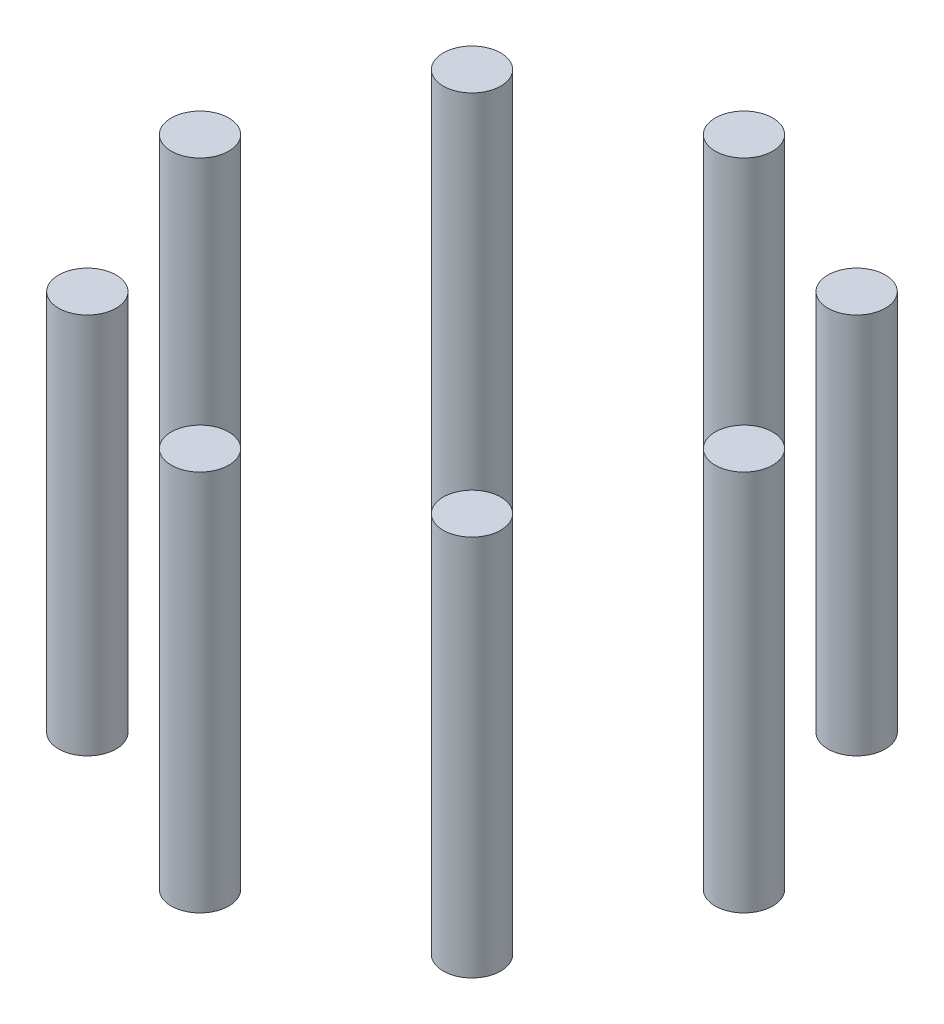
ISO-10303-21;
HEADER;
FILE_DESCRIPTION(('STEP AP214'),'2;1');
FILE_NAME('part.step','',(''),(''),'','','');
FILE_SCHEMA(('AUTOMOTIVE_DESIGN { 1 0 10303 214 1 1 1 1 }'));
ENDSEC;
DATA;
#1=APPLICATION_CONTEXT('core data for automotive mechanical design processes');
#2=APPLICATION_PROTOCOL_DEFINITION('international standard','automotive_design',2000,#1);
#3=PRODUCT_CONTEXT('',#1,'mechanical');
#4=PRODUCT('Part','Part','',(#3));
#5=PRODUCT_RELATED_PRODUCT_CATEGORY('part','',(#4));
#6=PRODUCT_DEFINITION_FORMATION('','',#4);
#7=PRODUCT_DEFINITION_CONTEXT('part definition',#1,'design');
#8=PRODUCT_DEFINITION('design','',#6,#7);
#9=PRODUCT_DEFINITION_SHAPE('','',#8);
#10=(LENGTH_UNIT() NAMED_UNIT(*) SI_UNIT(.MILLI.,.METRE.));
#11=(NAMED_UNIT(*) PLANE_ANGLE_UNIT() SI_UNIT($,.RADIAN.));
#12=(NAMED_UNIT(*) SI_UNIT($,.STERADIAN.) SOLID_ANGLE_UNIT());
#13=UNCERTAINTY_MEASURE_WITH_UNIT(LENGTH_MEASURE(1.E-05),#10,'distance_accuracy_value','');
#14=(GEOMETRIC_REPRESENTATION_CONTEXT(3) GLOBAL_UNCERTAINTY_ASSIGNED_CONTEXT((#13)) GLOBAL_UNIT_ASSIGNED_CONTEXT((#10,
#11,#12)) REPRESENTATION_CONTEXT('',''));
#15=CARTESIAN_POINT('',(0.,0.,0.));
#16=DIRECTION('',(0.,0.,1.));
#17=DIRECTION('',(1.,0.,0.));
#18=AXIS2_PLACEMENT_3D('',#15,#16,#17);
#19=CARTESIAN_POINT('',(-5.44671088859529E-13,73.,52.));
#20=DIRECTION('',(0.,-1.,0.));
#21=DIRECTION('',(0.,0.,-1.));
#22=AXIS2_PLACEMENT_3D('',#19,#20,#21);
#23=CYLINDRICAL_SURFACE('',#22,5.49999999999999);
#24=CARTESIAN_POINT('',(-5.44671088859529E-13,73.,52.));
#25=DIRECTION('',(0.,1.,0.));
#26=DIRECTION('',(0.,0.,1.));
#27=AXIS2_PLACEMENT_3D('',#24,#25,#26);
#28=CIRCLE('',#27,5.49999999999999);
#29=CARTESIAN_POINT('',(-5.44671088859529E-13,73.,57.5));
#30=VERTEX_POINT('',#29);
#31=EDGE_CURVE('E48',#30,#30,#28,.T.);
#32=ORIENTED_EDGE('',*,*,#31,.F.);
#33=EDGE_LOOP('',(#32));
#34=FACE_BOUND('',#33,.T.);
#35=CARTESIAN_POINT('',(-5.44671088859529E-13,0.,52.));
#36=DIRECTION('',(0.,1.,0.));
#37=DIRECTION('',(0.,0.,1.));
#38=AXIS2_PLACEMENT_3D('',#35,#36,#37);
#39=CIRCLE('',#38,5.49999999999999);
#40=CARTESIAN_POINT('',(-5.44671088859529E-13,0.,57.5));
#41=VERTEX_POINT('',#40);
#42=EDGE_CURVE('E11',#41,#41,#39,.T.);
#43=ORIENTED_EDGE('',*,*,#42,.T.);
#44=EDGE_LOOP('',(#43));
#45=FACE_BOUND('',#44,.T.);
#46=ADVANCED_FACE('F44',(#34,#45),#23,.T.);
#47=CARTESIAN_POINT('',(-5.44671088859529E-13,73.,52.));
#48=DIRECTION('',(0.,1.,0.));
#49=DIRECTION('',(0.,0.,1.));
#50=AXIS2_PLACEMENT_3D('',#47,#48,#49);
#51=PLANE('',#50);
#52=ORIENTED_EDGE('',*,*,#31,.T.);
#53=EDGE_LOOP('',(#52));
#54=FACE_BOUND('',#53,.T.);
#55=ADVANCED_FACE('F46',(#54),#51,.T.);
#56=CARTESIAN_POINT('',(-5.44671088859529E-13,0.,52.));
#57=DIRECTION('',(0.,1.,0.));
#58=DIRECTION('',(0.,0.,1.));
#59=AXIS2_PLACEMENT_3D('',#56,#57,#58);
#60=PLANE('',#59);
#61=ORIENTED_EDGE('',*,*,#42,.F.);
#62=EDGE_LOOP('',(#61));
#63=FACE_BOUND('',#62,.T.);
#64=ADVANCED_FACE('F63',(#63),#60,.F.);
#65=CLOSED_SHELL('',(#46,#55,#64));
#66=MANIFOLD_SOLID_BREP('B2',#65);
#67=CARTESIAN_POINT('',(36.7695526217001,73.,36.7695526217008));
#68=DIRECTION('',(0.,-1.,0.));
#69=DIRECTION('',(0.,0.,-1.));
#70=AXIS2_PLACEMENT_3D('',#67,#68,#69);
#71=CYLINDRICAL_SURFACE('',#70,5.49999999999999);
#72=CARTESIAN_POINT('',(36.7695526217001,73.,36.7695526217008));
#73=DIRECTION('',(0.,1.,0.));
#74=DIRECTION('',(0.,0.,1.));
#75=AXIS2_PLACEMENT_3D('',#72,#73,#74);
#76=CIRCLE('',#75,5.49999999999999);
#77=CARTESIAN_POINT('',(36.7695526217001,73.,42.2695526217008));
#78=VERTEX_POINT('',#77);
#79=EDGE_CURVE('E103',#78,#78,#76,.T.);
#80=ORIENTED_EDGE('',*,*,#79,.F.);
#81=EDGE_LOOP('',(#80));
#82=FACE_BOUND('',#81,.T.);
#83=CARTESIAN_POINT('',(36.7695526217001,0.,36.7695526217008));
#84=DIRECTION('',(0.,1.,0.));
#85=DIRECTION('',(0.,0.,1.));
#86=AXIS2_PLACEMENT_3D('',#83,#84,#85);
#87=CIRCLE('',#86,5.49999999999999);
#88=CARTESIAN_POINT('',(36.7695526217001,0.,42.2695526217008));
#89=VERTEX_POINT('',#88);
#90=EDGE_CURVE('E43',#89,#89,#87,.T.);
#91=ORIENTED_EDGE('',*,*,#90,.T.);
#92=EDGE_LOOP('',(#91));
#93=FACE_BOUND('',#92,.T.);
#94=ADVANCED_FACE('F99',(#82,#93),#71,.T.);
#95=CARTESIAN_POINT('',(36.7695526217001,73.,36.7695526217008));
#96=DIRECTION('',(0.,1.,0.));
#97=DIRECTION('',(0.,0.,1.));
#98=AXIS2_PLACEMENT_3D('',#95,#96,#97);
#99=PLANE('',#98);
#100=ORIENTED_EDGE('',*,*,#79,.T.);
#101=EDGE_LOOP('',(#100));
#102=FACE_BOUND('',#101,.T.);
#103=ADVANCED_FACE('F101',(#102),#99,.T.);
#104=CARTESIAN_POINT('',(36.7695526217001,0.,36.7695526217008));
#105=DIRECTION('',(0.,1.,0.));
#106=DIRECTION('',(0.,0.,1.));
#107=AXIS2_PLACEMENT_3D('',#104,#105,#106);
#108=PLANE('',#107);
#109=ORIENTED_EDGE('',*,*,#90,.F.);
#110=EDGE_LOOP('',(#109));
#111=FACE_BOUND('',#110,.T.);
#112=ADVANCED_FACE('F118',(#111),#108,.F.);
#113=CLOSED_SHELL('',(#94,#103,#112));
#114=MANIFOLD_SOLID_BREP('B6',#113);
#115=CARTESIAN_POINT('',(52.,73.,3.63114059239686E-13));
#116=DIRECTION('',(0.,-1.,0.));
#117=DIRECTION('',(0.,0.,-1.));
#118=AXIS2_PLACEMENT_3D('',#115,#116,#117);
#119=CYLINDRICAL_SURFACE('',#118,5.5);
#120=CARTESIAN_POINT('',(52.,73.,3.63114059239686E-13));
#121=DIRECTION('',(0.,1.,0.));
#122=DIRECTION('',(0.,0.,1.));
#123=AXIS2_PLACEMENT_3D('',#120,#121,#122);
#124=CIRCLE('',#123,5.5);
#125=CARTESIAN_POINT('',(52.,73.,5.50000000000036));
#126=VERTEX_POINT('',#125);
#127=EDGE_CURVE('E158',#126,#126,#124,.T.);
#128=ORIENTED_EDGE('',*,*,#127,.F.);
#129=EDGE_LOOP('',(#128));
#130=FACE_BOUND('',#129,.T.);
#131=CARTESIAN_POINT('',(52.,0.,3.63114059239686E-13));
#132=DIRECTION('',(0.,1.,0.));
#133=DIRECTION('',(0.,0.,1.));
#134=AXIS2_PLACEMENT_3D('',#131,#132,#133);
#135=CIRCLE('',#134,5.5);
#136=CARTESIAN_POINT('',(52.,0.,5.50000000000036));
#137=VERTEX_POINT('',#136);
#138=EDGE_CURVE('E98',#137,#137,#135,.T.);
#139=ORIENTED_EDGE('',*,*,#138,.T.);
#140=EDGE_LOOP('',(#139));
#141=FACE_BOUND('',#140,.T.);
#142=ADVANCED_FACE('F154',(#130,#141),#119,.T.);
#143=CARTESIAN_POINT('',(52.,73.,3.63114059239686E-13));
#144=DIRECTION('',(0.,1.,0.));
#145=DIRECTION('',(0.,0.,1.));
#146=AXIS2_PLACEMENT_3D('',#143,#144,#145);
#147=PLANE('',#146);
#148=ORIENTED_EDGE('',*,*,#127,.T.);
#149=EDGE_LOOP('',(#148));
#150=FACE_BOUND('',#149,.T.);
#151=ADVANCED_FACE('F156',(#150),#147,.T.);
#152=CARTESIAN_POINT('',(52.,0.,3.63114059239686E-13));
#153=DIRECTION('',(0.,1.,0.));
#154=DIRECTION('',(0.,0.,1.));
#155=AXIS2_PLACEMENT_3D('',#152,#153,#154);
#156=PLANE('',#155);
#157=ORIENTED_EDGE('',*,*,#138,.F.);
#158=EDGE_LOOP('',(#157));
#159=FACE_BOUND('',#158,.T.);
#160=ADVANCED_FACE('F173',(#159),#156,.F.);
#161=CLOSED_SHELL('',(#142,#151,#160));
#162=MANIFOLD_SOLID_BREP('B38',#161);
#163=CARTESIAN_POINT('',(36.7695526217007,73.,-36.7695526217003));
#164=DIRECTION('',(0.,-1.,0.));
#165=DIRECTION('',(0.,0.,-1.));
#166=AXIS2_PLACEMENT_3D('',#163,#164,#165);
#167=CYLINDRICAL_SURFACE('',#166,5.49999999999999);
#168=CARTESIAN_POINT('',(36.7695526217007,73.,-36.7695526217003));
#169=DIRECTION('',(0.,1.,0.));
#170=DIRECTION('',(0.,0.,1.));
#171=AXIS2_PLACEMENT_3D('',#168,#169,#170);
#172=CIRCLE('',#171,5.49999999999999);
#173=CARTESIAN_POINT('',(36.7695526217007,73.,-31.2695526217003));
#174=VERTEX_POINT('',#173);
#175=EDGE_CURVE('E213',#174,#174,#172,.T.);
#176=ORIENTED_EDGE('',*,*,#175,.F.);
#177=EDGE_LOOP('',(#176));
#178=FACE_BOUND('',#177,.T.);
#179=CARTESIAN_POINT('',(36.7695526217007,0.,-36.7695526217003));
#180=DIRECTION('',(0.,1.,0.));
#181=DIRECTION('',(0.,0.,1.));
#182=AXIS2_PLACEMENT_3D('',#179,#180,#181);
#183=CIRCLE('',#182,5.49999999999999);
#184=CARTESIAN_POINT('',(36.7695526217007,0.,-31.2695526217003));
#185=VERTEX_POINT('',#184);
#186=EDGE_CURVE('E153',#185,#185,#183,.T.);
#187=ORIENTED_EDGE('',*,*,#186,.T.);
#188=EDGE_LOOP('',(#187));
#189=FACE_BOUND('',#188,.T.);
#190=ADVANCED_FACE('F209',(#178,#189),#167,.T.);
#191=CARTESIAN_POINT('',(36.7695526217007,73.,-36.7695526217003));
#192=DIRECTION('',(0.,1.,0.));
#193=DIRECTION('',(0.,0.,1.));
#194=AXIS2_PLACEMENT_3D('',#191,#192,#193);
#195=PLANE('',#194);
#196=ORIENTED_EDGE('',*,*,#175,.T.);
#197=EDGE_LOOP('',(#196));
#198=FACE_BOUND('',#197,.T.);
#199=ADVANCED_FACE('F211',(#198),#195,.T.);
#200=CARTESIAN_POINT('',(36.7695526217007,0.,-36.7695526217003));
#201=DIRECTION('',(0.,1.,0.));
#202=DIRECTION('',(0.,0.,1.));
#203=AXIS2_PLACEMENT_3D('',#200,#201,#202);
#204=PLANE('',#203);
#205=ORIENTED_EDGE('',*,*,#186,.F.);
#206=EDGE_LOOP('',(#205));
#207=FACE_BOUND('',#206,.T.);
#208=ADVANCED_FACE('F228',(#207),#204,.F.);
#209=CLOSED_SHELL('',(#190,#199,#208));
#210=MANIFOLD_SOLID_BREP('B93',#209);
#211=CARTESIAN_POINT('',(1.81557029619843E-13,73.,-52.));
#212=DIRECTION('',(0.,-1.,0.));
#213=DIRECTION('',(0.,0.,-1.));
#214=AXIS2_PLACEMENT_3D('',#211,#212,#213);
#215=CYLINDRICAL_SURFACE('',#214,5.5);
#216=CARTESIAN_POINT('',(1.81557029619843E-13,73.,-52.));
#217=DIRECTION('',(0.,1.,0.));
#218=DIRECTION('',(0.,0.,1.));
#219=AXIS2_PLACEMENT_3D('',#216,#217,#218);
#220=CIRCLE('',#219,5.5);
#221=CARTESIAN_POINT('',(1.81557029619843E-13,73.,-46.5));
#222=VERTEX_POINT('',#221);
#223=EDGE_CURVE('E268',#222,#222,#220,.T.);
#224=ORIENTED_EDGE('',*,*,#223,.F.);
#225=EDGE_LOOP('',(#224));
#226=FACE_BOUND('',#225,.T.);
#227=CARTESIAN_POINT('',(1.81557029619843E-13,0.,-52.));
#228=DIRECTION('',(0.,1.,0.));
#229=DIRECTION('',(0.,0.,1.));
#230=AXIS2_PLACEMENT_3D('',#227,#228,#229);
#231=CIRCLE('',#230,5.5);
#232=CARTESIAN_POINT('',(1.81557029619843E-13,0.,-46.5));
#233=VERTEX_POINT('',#232);
#234=EDGE_CURVE('E208',#233,#233,#231,.T.);
#235=ORIENTED_EDGE('',*,*,#234,.T.);
#236=EDGE_LOOP('',(#235));
#237=FACE_BOUND('',#236,.T.);
#238=ADVANCED_FACE('F264',(#226,#237),#215,.T.);
#239=CARTESIAN_POINT('',(1.81557029619843E-13,73.,-52.));
#240=DIRECTION('',(0.,1.,0.));
#241=DIRECTION('',(0.,0.,1.));
#242=AXIS2_PLACEMENT_3D('',#239,#240,#241);
#243=PLANE('',#242);
#244=ORIENTED_EDGE('',*,*,#223,.T.);
#245=EDGE_LOOP('',(#244));
#246=FACE_BOUND('',#245,.T.);
#247=ADVANCED_FACE('F266',(#246),#243,.T.);
#248=CARTESIAN_POINT('',(1.81557029619843E-13,0.,-52.));
#249=DIRECTION('',(0.,1.,0.));
#250=DIRECTION('',(0.,0.,1.));
#251=AXIS2_PLACEMENT_3D('',#248,#249,#250);
#252=PLANE('',#251);
#253=ORIENTED_EDGE('',*,*,#234,.F.);
#254=EDGE_LOOP('',(#253));
#255=FACE_BOUND('',#254,.T.);
#256=ADVANCED_FACE('F283',(#255),#252,.F.);
#257=CLOSED_SHELL('',(#238,#247,#256));
#258=MANIFOLD_SOLID_BREP('B148',#257);
#259=CARTESIAN_POINT('',(-36.7695526217004,73.,-36.7695526217005));
#260=DIRECTION('',(0.,-1.,0.));
#261=DIRECTION('',(0.,0.,-1.));
#262=AXIS2_PLACEMENT_3D('',#259,#260,#261);
#263=CYLINDRICAL_SURFACE('',#262,5.5);
#264=CARTESIAN_POINT('',(-36.7695526217004,73.,-36.7695526217005));
#265=DIRECTION('',(0.,1.,0.));
#266=DIRECTION('',(0.,0.,1.));
#267=AXIS2_PLACEMENT_3D('',#264,#265,#266);
#268=CIRCLE('',#267,5.5);
#269=CARTESIAN_POINT('',(-36.7695526217004,73.,-31.2695526217006));
#270=VERTEX_POINT('',#269);
#271=EDGE_CURVE('E323',#270,#270,#268,.T.);
#272=ORIENTED_EDGE('',*,*,#271,.F.);
#273=EDGE_LOOP('',(#272));
#274=FACE_BOUND('',#273,.T.);
#275=CARTESIAN_POINT('',(-36.7695526217004,0.,-36.7695526217005));
#276=DIRECTION('',(0.,1.,0.));
#277=DIRECTION('',(0.,0.,1.));
#278=AXIS2_PLACEMENT_3D('',#275,#276,#277);
#279=CIRCLE('',#278,5.5);
#280=CARTESIAN_POINT('',(-36.7695526217004,0.,-31.2695526217006));
#281=VERTEX_POINT('',#280);
#282=EDGE_CURVE('E263',#281,#281,#279,.T.);
#283=ORIENTED_EDGE('',*,*,#282,.T.);
#284=EDGE_LOOP('',(#283));
#285=FACE_BOUND('',#284,.T.);
#286=ADVANCED_FACE('F319',(#274,#285),#263,.T.);
#287=CARTESIAN_POINT('',(-36.7695526217004,73.,-36.7695526217005));
#288=DIRECTION('',(0.,1.,0.));
#289=DIRECTION('',(0.,0.,1.));
#290=AXIS2_PLACEMENT_3D('',#287,#288,#289);
#291=PLANE('',#290);
#292=ORIENTED_EDGE('',*,*,#271,.T.);
#293=EDGE_LOOP('',(#292));
#294=FACE_BOUND('',#293,.T.);
#295=ADVANCED_FACE('F321',(#294),#291,.T.);
#296=CARTESIAN_POINT('',(-36.7695526217004,0.,-36.7695526217005));
#297=DIRECTION('',(0.,1.,0.));
#298=DIRECTION('',(0.,0.,1.));
#299=AXIS2_PLACEMENT_3D('',#296,#297,#298);
#300=PLANE('',#299);
#301=ORIENTED_EDGE('',*,*,#282,.F.);
#302=EDGE_LOOP('',(#301));
#303=FACE_BOUND('',#302,.T.);
#304=ADVANCED_FACE('F338',(#303),#300,.F.);
#305=CLOSED_SHELL('',(#286,#295,#304));
#306=MANIFOLD_SOLID_BREP('B203',#305);
#307=CARTESIAN_POINT('',(-36.7695526217009,73.,36.7695526217));
#308=DIRECTION('',(0.,-1.,0.));
#309=DIRECTION('',(0.,0.,-1.));
#310=AXIS2_PLACEMENT_3D('',#307,#308,#309);
#311=CYLINDRICAL_SURFACE('',#310,5.5);
#312=CARTESIAN_POINT('',(-36.7695526217009,73.,36.7695526217));
#313=DIRECTION('',(0.,1.,0.));
#314=DIRECTION('',(0.,0.,1.));
#315=AXIS2_PLACEMENT_3D('',#312,#313,#314);
#316=CIRCLE('',#315,5.5);
#317=CARTESIAN_POINT('',(-36.7695526217009,73.,42.2695526217));
#318=VERTEX_POINT('',#317);
#319=EDGE_CURVE('E377',#318,#318,#316,.T.);
#320=ORIENTED_EDGE('',*,*,#319,.F.);
#321=EDGE_LOOP('',(#320));
#322=FACE_BOUND('',#321,.T.);
#323=CARTESIAN_POINT('',(-36.7695526217009,0.,36.7695526217));
#324=DIRECTION('',(0.,1.,0.));
#325=DIRECTION('',(0.,0.,1.));
#326=AXIS2_PLACEMENT_3D('',#323,#324,#325);
#327=CIRCLE('',#326,5.5);
#328=CARTESIAN_POINT('',(-36.7695526217009,0.,42.2695526217));
#329=VERTEX_POINT('',#328);
#330=EDGE_CURVE('E318',#329,#329,#327,.T.);
#331=ORIENTED_EDGE('',*,*,#330,.T.);
#332=EDGE_LOOP('',(#331));
#333=FACE_BOUND('',#332,.T.);
#334=ADVANCED_FACE('F373',(#322,#333),#311,.T.);
#335=CARTESIAN_POINT('',(-36.7695526217009,73.,36.7695526217));
#336=DIRECTION('',(0.,1.,0.));
#337=DIRECTION('',(0.,0.,1.));
#338=AXIS2_PLACEMENT_3D('',#335,#336,#337);
#339=PLANE('',#338);
#340=ORIENTED_EDGE('',*,*,#319,.T.);
#341=EDGE_LOOP('',(#340));
#342=FACE_BOUND('',#341,.T.);
#343=ADVANCED_FACE('F375',(#342),#339,.T.);
#344=CARTESIAN_POINT('',(-36.7695526217009,0.,36.7695526217));
#345=DIRECTION('',(0.,1.,0.));
#346=DIRECTION('',(0.,0.,1.));
#347=AXIS2_PLACEMENT_3D('',#344,#345,#346);
#348=PLANE('',#347);
#349=ORIENTED_EDGE('',*,*,#330,.F.);
#350=EDGE_LOOP('',(#349));
#351=FACE_BOUND('',#350,.T.);
#352=ADVANCED_FACE('F392',(#351),#348,.F.);
#353=CLOSED_SHELL('',(#334,#343,#352));
#354=MANIFOLD_SOLID_BREP('B258',#353);
#355=CARTESIAN_POINT('',(-52.,73.,0.));
#356=DIRECTION('',(0.,-1.,0.));
#357=DIRECTION('',(0.,0.,-1.));
#358=AXIS2_PLACEMENT_3D('',#355,#356,#357);
#359=CYLINDRICAL_SURFACE('',#358,5.5);
#360=CARTESIAN_POINT('',(-52.,73.,0.));
#361=DIRECTION('',(0.,1.,0.));
#362=DIRECTION('',(0.,0.,1.));
#363=AXIS2_PLACEMENT_3D('',#360,#361,#362);
#364=CIRCLE('',#363,5.5);
#365=CARTESIAN_POINT('',(-52.,73.,5.5));
#366=VERTEX_POINT('',#365);
#367=EDGE_CURVE('E372',#366,#366,#364,.T.);
#368=ORIENTED_EDGE('',*,*,#367,.F.);
#369=EDGE_LOOP('',(#368));
#370=FACE_BOUND('',#369,.T.);
#371=CARTESIAN_POINT('',(-52.,0.,0.));
#372=DIRECTION('',(0.,1.,0.));
#373=DIRECTION('',(0.,0.,1.));
#374=AXIS2_PLACEMENT_3D('',#371,#372,#373);
#375=CIRCLE('',#374,5.5);
#376=CARTESIAN_POINT('',(-52.,0.,5.5));
#377=VERTEX_POINT('',#376);
#378=EDGE_CURVE('E423',#377,#377,#375,.T.);
#379=ORIENTED_EDGE('',*,*,#378,.T.);
#380=EDGE_LOOP('',(#379));
#381=FACE_BOUND('',#380,.T.);
#382=ADVANCED_FACE('F420',(#370,#381),#359,.T.);
#383=CARTESIAN_POINT('',(-52.,73.,0.));
#384=DIRECTION('',(0.,1.,0.));
#385=DIRECTION('',(0.,0.,1.));
#386=AXIS2_PLACEMENT_3D('',#383,#384,#385);
#387=PLANE('',#386);
#388=ORIENTED_EDGE('',*,*,#367,.T.);
#389=EDGE_LOOP('',(#388));
#390=FACE_BOUND('',#389,.T.);
#391=ADVANCED_FACE('F435',(#390),#387,.T.);
#392=CARTESIAN_POINT('',(-52.,0.,0.));
#393=DIRECTION('',(0.,1.,0.));
#394=DIRECTION('',(0.,0.,1.));
#395=AXIS2_PLACEMENT_3D('',#392,#393,#394);
#396=PLANE('',#395);
#397=ORIENTED_EDGE('',*,*,#378,.F.);
#398=EDGE_LOOP('',(#397));
#399=FACE_BOUND('',#398,.T.);
#400=ADVANCED_FACE('F433',(#399),#396,.F.);
#401=CLOSED_SHELL('',(#382,#391,#400));
#402=MANIFOLD_SOLID_BREP('B313',#401);
#403=ADVANCED_BREP_SHAPE_REPRESENTATION('',(#18,#66,#114,#162,#210,#258,#306,#354,#402),#14);
#404=SHAPE_DEFINITION_REPRESENTATION(#9,#403);
ENDSEC;
END-ISO-10303-21;
